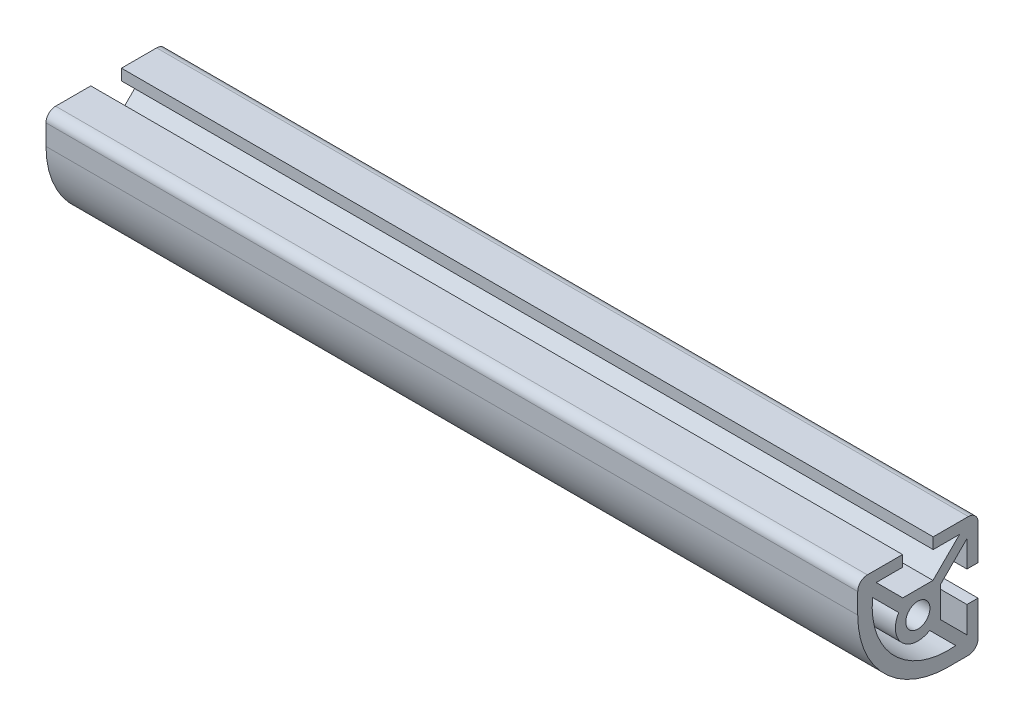
ISO-10303-21;
HEADER;
FILE_DESCRIPTION(('STEP AP214'),'2;1');
FILE_NAME('part.step','',(''),(''),'','','');
FILE_SCHEMA(('AUTOMOTIVE_DESIGN { 1 0 10303 214 1 1 1 1 }'));
ENDSEC;
DATA;
#1=APPLICATION_CONTEXT('core data for automotive mechanical design processes');
#2=APPLICATION_PROTOCOL_DEFINITION('international standard','automotive_design',2000,#1);
#3=PRODUCT_CONTEXT('',#1,'mechanical');
#4=PRODUCT('Part','Part','',(#3));
#5=PRODUCT_RELATED_PRODUCT_CATEGORY('part','',(#4));
#6=PRODUCT_DEFINITION_FORMATION('','',#4);
#7=PRODUCT_DEFINITION_CONTEXT('part definition',#1,'design');
#8=PRODUCT_DEFINITION('design','',#6,#7);
#9=PRODUCT_DEFINITION_SHAPE('','',#8);
#10=(LENGTH_UNIT() NAMED_UNIT(*) SI_UNIT(.MILLI.,.METRE.));
#11=(NAMED_UNIT(*) PLANE_ANGLE_UNIT() SI_UNIT($,.RADIAN.));
#12=(NAMED_UNIT(*) SI_UNIT($,.STERADIAN.) SOLID_ANGLE_UNIT());
#13=UNCERTAINTY_MEASURE_WITH_UNIT(LENGTH_MEASURE(1.E-05),#10,'distance_accuracy_value','');
#14=(GEOMETRIC_REPRESENTATION_CONTEXT(3) GLOBAL_UNCERTAINTY_ASSIGNED_CONTEXT((#13)) GLOBAL_UNIT_ASSIGNED_CONTEXT((#10,
#11,#12)) REPRESENTATION_CONTEXT('',''));
#15=CARTESIAN_POINT('',(0.,0.,0.));
#16=DIRECTION('',(0.,0.,1.));
#17=DIRECTION('',(1.,0.,0.));
#18=AXIS2_PLACEMENT_3D('',#15,#16,#17);
#19=CARTESIAN_POINT('',(85.7250000000001,10.668,10.6679999999999));
#20=DIRECTION('',(-1.,0.,0.));
#21=DIRECTION('',(0.,0.,1.));
#22=AXIS2_PLACEMENT_3D('',#19,#20,#21);
#23=PLANE('',#22);
#24=CARTESIAN_POINT('',(85.7250000000001,10.668,10.6679999999999));
#25=DIRECTION('',(1.,0.,0.));
#26=DIRECTION('',(0.,0.,1.));
#27=AXIS2_PLACEMENT_3D('',#24,#25,#26);
#28=CIRCLE('',#27,2.03200000000002);
#29=CARTESIAN_POINT('',(85.7250000000001,12.7,10.6679999999999));
#30=VERTEX_POINT('',#29);
#31=CARTESIAN_POINT('',(85.7250000000001,10.668,12.6999999999999));
#32=VERTEX_POINT('',#31);
#33=EDGE_CURVE('E229',#30,#32,#28,.T.);
#34=ORIENTED_EDGE('',*,*,#33,.T.);
#35=DIRECTION('',(0.,-1.,0.));
#36=VECTOR('',#35,1.);
#37=CARTESIAN_POINT('',(85.7250000000001,10.668,12.6999999999999));
#38=LINE('',#37,#36);
#39=CARTESIAN_POINT('',(85.7250000000001,6.35000000000034,12.6999999999999));
#40=VERTEX_POINT('',#39);
#41=EDGE_CURVE('E338',#32,#40,#38,.T.);
#42=ORIENTED_EDGE('',*,*,#41,.T.);
#43=CARTESIAN_POINT('',(85.7250000000001,6.35,-6.35000000000011));
#44=DIRECTION('',(1.,0.,0.));
#45=DIRECTION('',(0.,0.,-1.));
#46=AXIS2_PLACEMENT_3D('',#43,#44,#45);
#47=CIRCLE('',#46,19.05);
#48=CARTESIAN_POINT('',(85.7250000000001,-12.7,-6.35000000000012));
#49=VERTEX_POINT('',#48);
#50=EDGE_CURVE('E340',#40,#49,#47,.T.);
#51=ORIENTED_EDGE('',*,*,#50,.T.);
#52=DIRECTION('',(0.,0.,-1.));
#53=VECTOR('',#52,1.);
#54=CARTESIAN_POINT('',(85.7250000000001,-12.7,-10.6679999999999));
#55=LINE('',#54,#53);
#56=CARTESIAN_POINT('',(85.7250000000001,-12.7,-10.6679999999999));
#57=VERTEX_POINT('',#56);
#58=EDGE_CURVE('E342',#49,#57,#55,.T.);
#59=ORIENTED_EDGE('',*,*,#58,.T.);
#60=CARTESIAN_POINT('',(85.7250000000001,-10.668,-10.6679999999999));
#61=DIRECTION('',(1.,0.,0.));
#62=DIRECTION('',(0.,0.,1.));
#63=AXIS2_PLACEMENT_3D('',#60,#61,#62);
#64=CIRCLE('',#63,2.03200000000001);
#65=CARTESIAN_POINT('',(85.7250000000001,-10.668,-12.6999999999999));
#66=VERTEX_POINT('',#65);
#67=EDGE_CURVE('E344',#57,#66,#64,.T.);
#68=ORIENTED_EDGE('',*,*,#67,.T.);
#69=DIRECTION('',(0.,1.,0.));
#70=VECTOR('',#69,1.);
#71=CARTESIAN_POINT('',(85.7250000000001,-3.23850000000069,-12.6999999999999));
#72=LINE('',#71,#70);
#73=CARTESIAN_POINT('',(85.7250000000001,-3.23850000000069,-12.6999999999999));
#74=VERTEX_POINT('',#73);
#75=EDGE_CURVE('E346',#66,#74,#72,.T.);
#76=ORIENTED_EDGE('',*,*,#75,.T.);
#77=DIRECTION('',(0.,0.,1.));
#78=VECTOR('',#77,1.);
#79=CARTESIAN_POINT('',(85.7250000000001,-3.23850000000054,-10.3632000000016));
#80=LINE('',#79,#78);
#81=CARTESIAN_POINT('',(85.7250000000001,-3.23850000000054,-10.3632000000016));
#82=VERTEX_POINT('',#81);
#83=EDGE_CURVE('E348',#74,#82,#80,.T.);
#84=ORIENTED_EDGE('',*,*,#83,.T.);
#85=DIRECTION('',(0.,-1.,0.));
#86=VECTOR('',#85,1.);
#87=CARTESIAN_POINT('',(85.7250000000001,-8.80063543493584,-10.3632000000016));
#88=LINE('',#87,#86);
#89=CARTESIAN_POINT('',(85.7250000000001,-8.80063543493584,-10.3632000000016));
#90=VERTEX_POINT('',#89);
#91=EDGE_CURVE('E350',#82,#90,#88,.T.);
#92=ORIENTED_EDGE('',*,*,#91,.T.);
#93=DIRECTION('',(0.,0.707106781186543,0.707106781186552));
#94=VECTOR('',#93,1.);
#95=CARTESIAN_POINT('',(85.7250000000001,-3.18723566949115,-4.74980023455686));
#96=LINE('',#95,#94);
#97=CARTESIAN_POINT('',(85.7250000000001,-3.18723566949115,-4.74980023455686));
#98=VERTEX_POINT('',#97);
#99=EDGE_CURVE('E352',#90,#98,#96,.T.);
#100=ORIENTED_EDGE('',*,*,#99,.T.);
#101=DIRECTION('',(0.,1.,0.));
#102=VECTOR('',#101,1.);
#103=CARTESIAN_POINT('',(85.7250000000001,3.18723566949115,-4.74980023455665));
#104=LINE('',#103,#102);
#105=CARTESIAN_POINT('',(85.7250000000001,3.18723566949115,-4.74980023455665));
#106=VERTEX_POINT('',#105);
#107=EDGE_CURVE('E354',#98,#106,#104,.T.);
#108=ORIENTED_EDGE('',*,*,#107,.T.);
#109=DIRECTION('',(0.,0.707106781186543,-0.707106781186552));
#110=VECTOR('',#109,1.);
#111=CARTESIAN_POINT('',(85.7250000000001,8.80063543493585,-10.3632000000014));
#112=LINE('',#111,#110);
#113=CARTESIAN_POINT('',(85.7250000000001,8.80063543493585,-10.3632000000014));
#114=VERTEX_POINT('',#113);
#115=EDGE_CURVE('E356',#106,#114,#112,.T.);
#116=ORIENTED_EDGE('',*,*,#115,.T.);
#117=DIRECTION('',(0.,-1.,0.));
#118=VECTOR('',#117,1.);
#119=CARTESIAN_POINT('',(85.7250000000001,3.23850000000055,-10.3632000000014));
#120=LINE('',#119,#118);
#121=CARTESIAN_POINT('',(85.7250000000001,3.23850000000055,-10.3632000000014));
#122=VERTEX_POINT('',#121);
#123=EDGE_CURVE('E358',#114,#122,#120,.T.);
#124=ORIENTED_EDGE('',*,*,#123,.T.);
#125=DIRECTION('',(0.,0.,-1.));
#126=VECTOR('',#125,1.);
#127=CARTESIAN_POINT('',(85.7250000000001,3.23850000000069,-12.7));
#128=LINE('',#127,#126);
#129=CARTESIAN_POINT('',(85.7250000000001,3.23850000000069,-12.7));
#130=VERTEX_POINT('',#129);
#131=EDGE_CURVE('E360',#122,#130,#128,.T.);
#132=ORIENTED_EDGE('',*,*,#131,.T.);
#133=DIRECTION('',(0.,1.,0.));
#134=VECTOR('',#133,1.);
#135=CARTESIAN_POINT('',(85.7250000000001,10.668,-12.7));
#136=LINE('',#135,#134);
#137=CARTESIAN_POINT('',(85.7250000000001,10.668,-12.7));
#138=VERTEX_POINT('',#137);
#139=EDGE_CURVE('E362',#130,#138,#136,.T.);
#140=ORIENTED_EDGE('',*,*,#139,.T.);
#141=CARTESIAN_POINT('',(85.7250000000001,10.668,-10.668));
#142=DIRECTION('',(1.,0.,0.));
#143=DIRECTION('',(0.,0.,1.));
#144=AXIS2_PLACEMENT_3D('',#141,#142,#143);
#145=CIRCLE('',#144,2.03200000000001);
#146=CARTESIAN_POINT('',(85.7250000000001,12.7,-10.668));
#147=VERTEX_POINT('',#146);
#148=EDGE_CURVE('E364',#138,#147,#145,.T.);
#149=ORIENTED_EDGE('',*,*,#148,.T.);
#150=DIRECTION('',(0.,0.,1.));
#151=VECTOR('',#150,1.);
#152=CARTESIAN_POINT('',(85.7250000000001,12.7,-3.23850000000062));
#153=LINE('',#152,#151);
#154=CARTESIAN_POINT('',(85.7250000000001,12.7,-3.23850000000062));
#155=VERTEX_POINT('',#154);
#156=EDGE_CURVE('E366',#147,#155,#153,.T.);
#157=ORIENTED_EDGE('',*,*,#156,.T.);
#158=DIRECTION('',(0.,-1.,0.));
#159=VECTOR('',#158,1.);
#160=CARTESIAN_POINT('',(85.7250000000001,10.3632000000014,-3.23850000000062));
#161=LINE('',#160,#159);
#162=CARTESIAN_POINT('',(85.7250000000001,10.3632000000014,-3.23850000000062));
#163=VERTEX_POINT('',#162);
#164=EDGE_CURVE('E368',#155,#163,#161,.T.);
#165=ORIENTED_EDGE('',*,*,#164,.T.);
#166=DIRECTION('',(0.,0.,-1.));
#167=VECTOR('',#166,1.);
#168=CARTESIAN_POINT('',(85.7250000000001,10.3632000000014,-8.80063543493592));
#169=LINE('',#168,#167);
#170=CARTESIAN_POINT('',(85.7250000000001,10.3632000000014,-8.80063543493592));
#171=VERTEX_POINT('',#170);
#172=EDGE_CURVE('E370',#163,#171,#169,.T.);
#173=ORIENTED_EDGE('',*,*,#172,.T.);
#174=DIRECTION('',(0.,-0.707106781186537,0.707106781186558));
#175=VECTOR('',#174,1.);
#176=CARTESIAN_POINT('',(85.7250000000001,4.74980023455676,-3.18723566949106));
#177=LINE('',#176,#175);
#178=CARTESIAN_POINT('',(85.7250000000001,4.74980023455676,-3.18723566949106));
#179=VERTEX_POINT('',#178);
#180=EDGE_CURVE('E372',#171,#179,#177,.T.);
#181=ORIENTED_EDGE('',*,*,#180,.T.);
#182=DIRECTION('',(0.,0.,1.));
#183=VECTOR('',#182,1.);
#184=CARTESIAN_POINT('',(85.7250000000001,4.74980023455676,3.18723566949115));
#185=LINE('',#184,#183);
#186=CARTESIAN_POINT('',(85.7250000000001,4.74980023455676,3.18723566949115));
#187=VERTEX_POINT('',#186);
#188=EDGE_CURVE('E374',#179,#187,#185,.T.);
#189=ORIENTED_EDGE('',*,*,#188,.T.);
#190=DIRECTION('',(0.,0.707106781186543,0.707106781186552));
#191=VECTOR('',#190,1.);
#192=CARTESIAN_POINT('',(85.7250000000001,10.3632000000014,8.80063543493592));
#193=LINE('',#192,#191);
#194=CARTESIAN_POINT('',(85.7250000000001,10.3632000000014,8.80063543493592));
#195=VERTEX_POINT('',#194);
#196=EDGE_CURVE('E376',#187,#195,#193,.T.);
#197=ORIENTED_EDGE('',*,*,#196,.T.);
#198=DIRECTION('',(0.,0.,-1.));
#199=VECTOR('',#198,1.);
#200=CARTESIAN_POINT('',(85.7250000000001,10.3632000000014,3.23850000000062));
#201=LINE('',#200,#199);
#202=CARTESIAN_POINT('',(85.7250000000001,10.3632000000014,3.23850000000062));
#203=VERTEX_POINT('',#202);
#204=EDGE_CURVE('E378',#195,#203,#201,.T.);
#205=ORIENTED_EDGE('',*,*,#204,.T.);
#206=DIRECTION('',(0.,1.,0.));
#207=VECTOR('',#206,1.);
#208=CARTESIAN_POINT('',(85.7250000000001,12.7,3.23850000000062));
#209=LINE('',#208,#207);
#210=CARTESIAN_POINT('',(85.7250000000001,12.7,3.23850000000062));
#211=VERTEX_POINT('',#210);
#212=EDGE_CURVE('E380',#203,#211,#209,.T.);
#213=ORIENTED_EDGE('',*,*,#212,.T.);
#214=DIRECTION('',(0.,0.,1.));
#215=VECTOR('',#214,1.);
#216=CARTESIAN_POINT('',(85.7250000000001,12.7,10.6679999999999));
#217=LINE('',#216,#215);
#218=EDGE_CURVE('E56',#211,#30,#217,.T.);
#219=ORIENTED_EDGE('',*,*,#218,.T.);
#220=EDGE_LOOP('',(#34,#42,#51,#59,#68,#76,#84,#92,#100,#108,#116,#124,#132,#140,#149,#157,#165,
#173,#181,#189,#197,#205,#213,#219));
#221=FACE_BOUND('',#220,.T.);
#222=CARTESIAN_POINT('',(85.7250000000001,0.,0.));
#223=DIRECTION('',(-1.,0.,0.));
#224=DIRECTION('',(0.,0.,-1.));
#225=AXIS2_PLACEMENT_3D('',#222,#223,#224);
#226=CIRCLE('',#225,4.74980023455676);
#227=CARTESIAN_POINT('',(85.7250000000001,-4.04776343648096,-2.48519887141517));
#228=VERTEX_POINT('',#227);
#229=CARTESIAN_POINT('',(85.7250000000001,2.48519887141525,4.04776343648091));
#230=VERTEX_POINT('',#229);
#231=EDGE_CURVE('E226',#228,#230,#226,.T.);
#232=ORIENTED_EDGE('',*,*,#231,.F.);
#233=DIRECTION('',(0.,0.707106781186554,0.707106781186541));
#234=VECTOR('',#233,1.);
#235=CARTESIAN_POINT('',(85.7250000000001,-4.04776343648096,-2.48519887141517));
#236=LINE('',#235,#234);
#237=CARTESIAN_POINT('',(85.7250000000001,-9.56631586282329,-8.00375129775741));
#238=VERTEX_POINT('',#237);
#239=EDGE_CURVE('E331',#238,#228,#236,.T.);
#240=ORIENTED_EDGE('',*,*,#239,.F.);
#241=CARTESIAN_POINT('',(85.7250000000001,6.34999999999999,-6.35000000000011));
#242=DIRECTION('',(1.,0.,0.));
#243=DIRECTION('',(0.,0.,-1.));
#244=AXIS2_PLACEMENT_3D('',#241,#242,#243);
#245=CIRCLE('',#244,16.0019999999998);
#246=CARTESIAN_POINT('',(85.7250000000001,8.00375129775759,9.56631586282315));
#247=VERTEX_POINT('',#246);
#248=EDGE_CURVE('E329',#247,#238,#245,.T.);
#249=ORIENTED_EDGE('',*,*,#248,.F.);
#250=DIRECTION('',(0.,0.707106781186554,0.707106781186541));
#251=VECTOR('',#250,1.);
#252=CARTESIAN_POINT('',(85.7250000000001,8.00375129775759,9.56631586282315));
#253=LINE('',#252,#251);
#254=EDGE_CURVE('E327',#230,#247,#253,.T.);
#255=ORIENTED_EDGE('',*,*,#254,.F.);
#256=EDGE_LOOP('',(#232,#240,#249,#255));
#257=FACE_BOUND('',#256,.T.);
#258=CARTESIAN_POINT('',(85.7250000000001,0.,0.));
#259=DIRECTION('',(1.,0.,0.));
#260=DIRECTION('',(0.,0.,-1.));
#261=AXIS2_PLACEMENT_3D('',#258,#259,#260);
#262=CIRCLE('',#261,2.55269999999991);
#263=CARTESIAN_POINT('',(85.7250000000001,0.,-2.55269999999991));
#264=VERTEX_POINT('',#263);
#265=EDGE_CURVE('E323',#264,#264,#262,.T.);
#266=ORIENTED_EDGE('',*,*,#265,.F.);
#267=EDGE_LOOP('',(#266));
#268=FACE_BOUND('',#267,.T.);
#269=ADVANCED_FACE('F33',(#221,#257,#268),#23,.F.);
#270=CARTESIAN_POINT('',(85.7250000000001,10.668,10.6679999999999));
#271=DIRECTION('',(-1.,0.,0.));
#272=DIRECTION('',(0.,0.,1.));
#273=AXIS2_PLACEMENT_3D('',#270,#271,#272);
#274=CYLINDRICAL_SURFACE('',#273,2.03200000000002);
#275=DIRECTION('',(-1.,0.,0.));
#276=VECTOR('',#275,1.);
#277=CARTESIAN_POINT('',(85.7250000000001,12.7,10.6679999999999));
#278=LINE('',#277,#276);
#279=CARTESIAN_POINT('',(-85.7250000000001,12.7,10.6679999999999));
#280=VERTEX_POINT('',#279);
#281=EDGE_CURVE('E383',#30,#280,#278,.T.);
#282=ORIENTED_EDGE('',*,*,#281,.T.);
#283=CARTESIAN_POINT('',(-85.7250000000001,10.668,10.6679999999999));
#284=DIRECTION('',(1.,0.,0.));
#285=DIRECTION('',(0.,0.,1.));
#286=AXIS2_PLACEMENT_3D('',#283,#284,#285);
#287=CIRCLE('',#286,2.03200000000002);
#288=CARTESIAN_POINT('',(-85.7250000000001,10.668,12.6999999999999));
#289=VERTEX_POINT('',#288);
#290=EDGE_CURVE('E251',#280,#289,#287,.T.);
#291=ORIENTED_EDGE('',*,*,#290,.T.);
#292=DIRECTION('',(-1.,0.,0.));
#293=VECTOR('',#292,1.);
#294=CARTESIAN_POINT('',(85.7250000000001,10.668,12.6999999999999));
#295=LINE('',#294,#293);
#296=EDGE_CURVE('E11',#32,#289,#295,.T.);
#297=ORIENTED_EDGE('',*,*,#296,.F.);
#298=ORIENTED_EDGE('',*,*,#33,.F.);
#299=EDGE_LOOP('',(#282,#291,#297,#298));
#300=FACE_BOUND('',#299,.T.);
#301=ADVANCED_FACE('F35',(#300),#274,.T.);
#302=CARTESIAN_POINT('',(85.7250000000001,10.668,12.6999999999999));
#303=DIRECTION('',(0.,0.,-1.));
#304=DIRECTION('',(-1.,0.,0.));
#305=AXIS2_PLACEMENT_3D('',#302,#303,#304);
#306=PLANE('',#305);
#307=ORIENTED_EDGE('',*,*,#296,.T.);
#308=DIRECTION('',(0.,-1.,0.));
#309=VECTOR('',#308,1.);
#310=CARTESIAN_POINT('',(-85.7250000000001,10.668,12.6999999999999));
#311=LINE('',#310,#309);
#312=CARTESIAN_POINT('',(-85.7250000000001,6.35000000000034,12.6999999999999));
#313=VERTEX_POINT('',#312);
#314=EDGE_CURVE('E254',#289,#313,#311,.T.);
#315=ORIENTED_EDGE('',*,*,#314,.T.);
#316=DIRECTION('',(-1.,0.,0.));
#317=VECTOR('',#316,1.);
#318=CARTESIAN_POINT('',(85.7250000000001,6.35000000000034,12.6999999999999));
#319=LINE('',#318,#317);
#320=EDGE_CURVE('E41',#40,#313,#319,.T.);
#321=ORIENTED_EDGE('',*,*,#320,.F.);
#322=ORIENTED_EDGE('',*,*,#41,.F.);
#323=EDGE_LOOP('',(#307,#315,#321,#322));
#324=FACE_BOUND('',#323,.T.);
#325=ADVANCED_FACE('F437',(#324),#306,.F.);
#326=CARTESIAN_POINT('',(85.7250000000001,6.35,-6.35000000000011));
#327=DIRECTION('',(-1.,0.,0.));
#328=DIRECTION('',(0.,0.,1.));
#329=AXIS2_PLACEMENT_3D('',#326,#327,#328);
#330=CYLINDRICAL_SURFACE('',#329,19.05);
#331=ORIENTED_EDGE('',*,*,#320,.T.);
#332=CARTESIAN_POINT('',(-85.7250000000001,6.35,-6.35000000000011));
#333=DIRECTION('',(1.,0.,0.));
#334=DIRECTION('',(0.,0.,-1.));
#335=AXIS2_PLACEMENT_3D('',#332,#333,#334);
#336=CIRCLE('',#335,19.05);
#337=CARTESIAN_POINT('',(-85.7250000000001,-12.7,-6.35000000000012));
#338=VERTEX_POINT('',#337);
#339=EDGE_CURVE('E257',#313,#338,#336,.T.);
#340=ORIENTED_EDGE('',*,*,#339,.T.);
#341=DIRECTION('',(-1.,0.,0.));
#342=VECTOR('',#341,1.);
#343=CARTESIAN_POINT('',(85.7250000000001,-12.7,-6.35000000000012));
#344=LINE('',#343,#342);
#345=EDGE_CURVE('E425',#49,#338,#344,.T.);
#346=ORIENTED_EDGE('',*,*,#345,.F.);
#347=ORIENTED_EDGE('',*,*,#50,.F.);
#348=EDGE_LOOP('',(#331,#340,#346,#347));
#349=FACE_BOUND('',#348,.T.);
#350=ADVANCED_FACE('F430',(#349),#330,.T.);
#351=CARTESIAN_POINT('',(85.7250000000001,-12.7,-10.6679999999999));
#352=DIRECTION('',(0.,1.,0.));
#353=DIRECTION('',(0.,0.,1.));
#354=AXIS2_PLACEMENT_3D('',#351,#352,#353);
#355=PLANE('',#354);
#356=ORIENTED_EDGE('',*,*,#345,.T.);
#357=DIRECTION('',(0.,0.,-1.));
#358=VECTOR('',#357,1.);
#359=CARTESIAN_POINT('',(-85.7250000000001,-12.7,-10.6679999999999));
#360=LINE('',#359,#358);
#361=CARTESIAN_POINT('',(-85.7250000000001,-12.7,-10.6679999999999));
#362=VERTEX_POINT('',#361);
#363=EDGE_CURVE('E260',#338,#362,#360,.T.);
#364=ORIENTED_EDGE('',*,*,#363,.T.);
#365=DIRECTION('',(-1.,0.,0.));
#366=VECTOR('',#365,1.);
#367=CARTESIAN_POINT('',(85.7250000000001,-12.7,-10.6679999999999));
#368=LINE('',#367,#366);
#369=EDGE_CURVE('E423',#57,#362,#368,.T.);
#370=ORIENTED_EDGE('',*,*,#369,.F.);
#371=ORIENTED_EDGE('',*,*,#58,.F.);
#372=EDGE_LOOP('',(#356,#364,#370,#371));
#373=FACE_BOUND('',#372,.T.);
#374=ADVANCED_FACE('F540',(#373),#355,.F.);
#375=CARTESIAN_POINT('',(85.7250000000001,-10.668,-10.6679999999999));
#376=DIRECTION('',(-1.,0.,0.));
#377=DIRECTION('',(0.,0.,1.));
#378=AXIS2_PLACEMENT_3D('',#375,#376,#377);
#379=CYLINDRICAL_SURFACE('',#378,2.03200000000001);
#380=ORIENTED_EDGE('',*,*,#369,.T.);
#381=CARTESIAN_POINT('',(-85.7250000000001,-10.668,-10.6679999999999));
#382=DIRECTION('',(1.,0.,0.));
#383=DIRECTION('',(0.,0.,1.));
#384=AXIS2_PLACEMENT_3D('',#381,#382,#383);
#385=CIRCLE('',#384,2.03200000000001);
#386=CARTESIAN_POINT('',(-85.7250000000001,-10.668,-12.6999999999999));
#387=VERTEX_POINT('',#386);
#388=EDGE_CURVE('E263',#362,#387,#385,.T.);
#389=ORIENTED_EDGE('',*,*,#388,.T.);
#390=DIRECTION('',(-1.,0.,0.));
#391=VECTOR('',#390,1.);
#392=CARTESIAN_POINT('',(85.7250000000001,-10.668,-12.6999999999999));
#393=LINE('',#392,#391);
#394=EDGE_CURVE('E421',#66,#387,#393,.T.);
#395=ORIENTED_EDGE('',*,*,#394,.F.);
#396=ORIENTED_EDGE('',*,*,#67,.F.);
#397=EDGE_LOOP('',(#380,#389,#395,#396));
#398=FACE_BOUND('',#397,.T.);
#399=ADVANCED_FACE('F537',(#398),#379,.T.);
#400=CARTESIAN_POINT('',(85.7250000000001,-3.23850000000069,-12.6999999999999));
#401=DIRECTION('',(0.,0.,1.));
#402=DIRECTION('',(1.,0.,0.));
#403=AXIS2_PLACEMENT_3D('',#400,#401,#402);
#404=PLANE('',#403);
#405=ORIENTED_EDGE('',*,*,#394,.T.);
#406=DIRECTION('',(0.,1.,0.));
#407=VECTOR('',#406,1.);
#408=CARTESIAN_POINT('',(-85.7250000000001,-3.23850000000069,-12.6999999999999));
#409=LINE('',#408,#407);
#410=CARTESIAN_POINT('',(-85.7250000000001,-3.23850000000069,-12.6999999999999));
#411=VERTEX_POINT('',#410);
#412=EDGE_CURVE('E266',#387,#411,#409,.T.);
#413=ORIENTED_EDGE('',*,*,#412,.T.);
#414=DIRECTION('',(-1.,0.,0.));
#415=VECTOR('',#414,1.);
#416=CARTESIAN_POINT('',(85.7250000000001,-3.23850000000069,-12.6999999999999));
#417=LINE('',#416,#415);
#418=EDGE_CURVE('E419',#74,#411,#417,.T.);
#419=ORIENTED_EDGE('',*,*,#418,.F.);
#420=ORIENTED_EDGE('',*,*,#75,.F.);
#421=EDGE_LOOP('',(#405,#413,#419,#420));
#422=FACE_BOUND('',#421,.T.);
#423=ADVANCED_FACE('F532',(#422),#404,.F.);
#424=CARTESIAN_POINT('',(85.7250000000001,-3.23850000000054,-10.3632000000016));
#425=DIRECTION('',(0.,-1.,0.));
#426=DIRECTION('',(0.,0.,-1.));
#427=AXIS2_PLACEMENT_3D('',#424,#425,#426);
#428=PLANE('',#427);
#429=ORIENTED_EDGE('',*,*,#418,.T.);
#430=DIRECTION('',(0.,0.,1.));
#431=VECTOR('',#430,1.);
#432=CARTESIAN_POINT('',(-85.7250000000001,-3.23850000000054,-10.3632000000016));
#433=LINE('',#432,#431);
#434=CARTESIAN_POINT('',(-85.7250000000001,-3.23850000000054,-10.3632000000016));
#435=VERTEX_POINT('',#434);
#436=EDGE_CURVE('E269',#411,#435,#433,.T.);
#437=ORIENTED_EDGE('',*,*,#436,.T.);
#438=DIRECTION('',(-1.,0.,0.));
#439=VECTOR('',#438,1.);
#440=CARTESIAN_POINT('',(85.7250000000001,-3.23850000000054,-10.3632000000016));
#441=LINE('',#440,#439);
#442=EDGE_CURVE('E417',#82,#435,#441,.T.);
#443=ORIENTED_EDGE('',*,*,#442,.F.);
#444=ORIENTED_EDGE('',*,*,#83,.F.);
#445=EDGE_LOOP('',(#429,#437,#443,#444));
#446=FACE_BOUND('',#445,.T.);
#447=ADVANCED_FACE('F528',(#446),#428,.F.);
#448=CARTESIAN_POINT('',(85.7250000000001,-8.80063543493584,-10.3632000000016));
#449=DIRECTION('',(0.,0.,-1.));
#450=DIRECTION('',(-1.,0.,0.));
#451=AXIS2_PLACEMENT_3D('',#448,#449,#450);
#452=PLANE('',#451);
#453=ORIENTED_EDGE('',*,*,#442,.T.);
#454=DIRECTION('',(0.,-1.,0.));
#455=VECTOR('',#454,1.);
#456=CARTESIAN_POINT('',(-85.7250000000001,-8.80063543493584,-10.3632000000016));
#457=LINE('',#456,#455);
#458=CARTESIAN_POINT('',(-85.7250000000001,-8.80063543493584,-10.3632000000016));
#459=VERTEX_POINT('',#458);
#460=EDGE_CURVE('E272',#435,#459,#457,.T.);
#461=ORIENTED_EDGE('',*,*,#460,.T.);
#462=DIRECTION('',(-1.,0.,0.));
#463=VECTOR('',#462,1.);
#464=CARTESIAN_POINT('',(85.7250000000001,-8.80063543493584,-10.3632000000016));
#465=LINE('',#464,#463);
#466=EDGE_CURVE('E415',#90,#459,#465,.T.);
#467=ORIENTED_EDGE('',*,*,#466,.F.);
#468=ORIENTED_EDGE('',*,*,#91,.F.);
#469=EDGE_LOOP('',(#453,#461,#467,#468));
#470=FACE_BOUND('',#469,.T.);
#471=ADVANCED_FACE('F523',(#470),#452,.F.);
#472=CARTESIAN_POINT('',(85.7250000000001,-3.18723566949115,-4.74980023455686));
#473=DIRECTION('',(0.,-0.707106781186552,0.707106781186543));
#474=DIRECTION('',(0.,-0.707106781186543,-0.707106781186552));
#475=AXIS2_PLACEMENT_3D('',#472,#473,#474);
#476=PLANE('',#475);
#477=ORIENTED_EDGE('',*,*,#466,.T.);
#478=DIRECTION('',(0.,0.707106781186543,0.707106781186552));
#479=VECTOR('',#478,1.);
#480=CARTESIAN_POINT('',(-85.7250000000001,-3.18723566949115,-4.74980023455686));
#481=LINE('',#480,#479);
#482=CARTESIAN_POINT('',(-85.7250000000001,-3.18723566949115,-4.74980023455686));
#483=VERTEX_POINT('',#482);
#484=EDGE_CURVE('E275',#459,#483,#481,.T.);
#485=ORIENTED_EDGE('',*,*,#484,.T.);
#486=DIRECTION('',(-1.,0.,0.));
#487=VECTOR('',#486,1.);
#488=CARTESIAN_POINT('',(85.7250000000001,-3.18723566949115,-4.74980023455686));
#489=LINE('',#488,#487);
#490=EDGE_CURVE('E413',#98,#483,#489,.T.);
#491=ORIENTED_EDGE('',*,*,#490,.F.);
#492=ORIENTED_EDGE('',*,*,#99,.F.);
#493=EDGE_LOOP('',(#477,#485,#491,#492));
#494=FACE_BOUND('',#493,.T.);
#495=ADVANCED_FACE('F518',(#494),#476,.F.);
#496=CARTESIAN_POINT('',(85.7250000000001,3.18723566949115,-4.74980023455665));
#497=DIRECTION('',(0.,0.,1.));
#498=DIRECTION('',(0.,-1.,0.));
#499=AXIS2_PLACEMENT_3D('',#496,#497,#498);
#500=PLANE('',#499);
#501=ORIENTED_EDGE('',*,*,#490,.T.);
#502=DIRECTION('',(0.,1.,0.));
#503=VECTOR('',#502,1.);
#504=CARTESIAN_POINT('',(-85.7250000000001,3.18723566949115,-4.74980023455665));
#505=LINE('',#504,#503);
#506=CARTESIAN_POINT('',(-85.7250000000001,3.18723566949115,-4.74980023455665));
#507=VERTEX_POINT('',#506);
#508=EDGE_CURVE('E278',#483,#507,#505,.T.);
#509=ORIENTED_EDGE('',*,*,#508,.T.);
#510=DIRECTION('',(-1.,0.,0.));
#511=VECTOR('',#510,1.);
#512=CARTESIAN_POINT('',(85.7250000000001,3.18723566949115,-4.74980023455665));
#513=LINE('',#512,#511);
#514=EDGE_CURVE('E411',#106,#507,#513,.T.);
#515=ORIENTED_EDGE('',*,*,#514,.F.);
#516=ORIENTED_EDGE('',*,*,#107,.F.);
#517=EDGE_LOOP('',(#501,#509,#515,#516));
#518=FACE_BOUND('',#517,.T.);
#519=ADVANCED_FACE('F513',(#518),#500,.F.);
#520=CARTESIAN_POINT('',(85.7250000000001,8.80063543493585,-10.3632000000014));
#521=DIRECTION('',(0.,0.707106781186552,0.707106781186543));
#522=DIRECTION('',(0.,-0.707106781186543,0.707106781186552));
#523=AXIS2_PLACEMENT_3D('',#520,#521,#522);
#524=PLANE('',#523);
#525=ORIENTED_EDGE('',*,*,#514,.T.);
#526=DIRECTION('',(0.,0.707106781186543,-0.707106781186552));
#527=VECTOR('',#526,1.);
#528=CARTESIAN_POINT('',(-85.7250000000001,8.80063543493585,-10.3632000000014));
#529=LINE('',#528,#527);
#530=CARTESIAN_POINT('',(-85.7250000000001,8.80063543493585,-10.3632000000014));
#531=VERTEX_POINT('',#530);
#532=EDGE_CURVE('E281',#507,#531,#529,.T.);
#533=ORIENTED_EDGE('',*,*,#532,.T.);
#534=DIRECTION('',(-1.,0.,0.));
#535=VECTOR('',#534,1.);
#536=CARTESIAN_POINT('',(85.7250000000001,8.80063543493585,-10.3632000000014));
#537=LINE('',#536,#535);
#538=EDGE_CURVE('E409',#114,#531,#537,.T.);
#539=ORIENTED_EDGE('',*,*,#538,.F.);
#540=ORIENTED_EDGE('',*,*,#115,.F.);
#541=EDGE_LOOP('',(#525,#533,#539,#540));
#542=FACE_BOUND('',#541,.T.);
#543=ADVANCED_FACE('F508',(#542),#524,.F.);
#544=CARTESIAN_POINT('',(85.7250000000001,3.23850000000055,-10.3632000000014));
#545=DIRECTION('',(0.,0.,-1.));
#546=DIRECTION('',(-1.,0.,0.));
#547=AXIS2_PLACEMENT_3D('',#544,#545,#546);
#548=PLANE('',#547);
#549=ORIENTED_EDGE('',*,*,#538,.T.);
#550=DIRECTION('',(0.,-1.,0.));
#551=VECTOR('',#550,1.);
#552=CARTESIAN_POINT('',(-85.7250000000001,3.23850000000055,-10.3632000000014));
#553=LINE('',#552,#551);
#554=CARTESIAN_POINT('',(-85.7250000000001,3.23850000000055,-10.3632000000014));
#555=VERTEX_POINT('',#554);
#556=EDGE_CURVE('E284',#531,#555,#553,.T.);
#557=ORIENTED_EDGE('',*,*,#556,.T.);
#558=DIRECTION('',(-1.,0.,0.));
#559=VECTOR('',#558,1.);
#560=CARTESIAN_POINT('',(85.7250000000001,3.23850000000055,-10.3632000000014));
#561=LINE('',#560,#559);
#562=EDGE_CURVE('E407',#122,#555,#561,.T.);
#563=ORIENTED_EDGE('',*,*,#562,.F.);
#564=ORIENTED_EDGE('',*,*,#123,.F.);
#565=EDGE_LOOP('',(#549,#557,#563,#564));
#566=FACE_BOUND('',#565,.T.);
#567=ADVANCED_FACE('F503',(#566),#548,.F.);
#568=CARTESIAN_POINT('',(85.7250000000001,3.23850000000069,-12.7));
#569=DIRECTION('',(0.,1.,0.));
#570=DIRECTION('',(0.,0.,1.));
#571=AXIS2_PLACEMENT_3D('',#568,#569,#570);
#572=PLANE('',#571);
#573=ORIENTED_EDGE('',*,*,#562,.T.);
#574=DIRECTION('',(0.,0.,-1.));
#575=VECTOR('',#574,1.);
#576=CARTESIAN_POINT('',(-85.7250000000001,3.23850000000069,-12.7));
#577=LINE('',#576,#575);
#578=CARTESIAN_POINT('',(-85.7250000000001,3.23850000000069,-12.7));
#579=VERTEX_POINT('',#578);
#580=EDGE_CURVE('E287',#555,#579,#577,.T.);
#581=ORIENTED_EDGE('',*,*,#580,.T.);
#582=DIRECTION('',(-1.,0.,0.));
#583=VECTOR('',#582,1.);
#584=CARTESIAN_POINT('',(85.7250000000001,3.23850000000069,-12.7));
#585=LINE('',#584,#583);
#586=EDGE_CURVE('E405',#130,#579,#585,.T.);
#587=ORIENTED_EDGE('',*,*,#586,.F.);
#588=ORIENTED_EDGE('',*,*,#131,.F.);
#589=EDGE_LOOP('',(#573,#581,#587,#588));
#590=FACE_BOUND('',#589,.T.);
#591=ADVANCED_FACE('F498',(#590),#572,.F.);
#592=CARTESIAN_POINT('',(85.7250000000001,10.668,-12.7));
#593=DIRECTION('',(0.,0.,1.));
#594=DIRECTION('',(1.,0.,0.));
#595=AXIS2_PLACEMENT_3D('',#592,#593,#594);
#596=PLANE('',#595);
#597=ORIENTED_EDGE('',*,*,#586,.T.);
#598=DIRECTION('',(0.,1.,0.));
#599=VECTOR('',#598,1.);
#600=CARTESIAN_POINT('',(-85.7250000000001,10.668,-12.7));
#601=LINE('',#600,#599);
#602=CARTESIAN_POINT('',(-85.7250000000001,10.668,-12.7));
#603=VERTEX_POINT('',#602);
#604=EDGE_CURVE('E290',#579,#603,#601,.T.);
#605=ORIENTED_EDGE('',*,*,#604,.T.);
#606=DIRECTION('',(-1.,0.,0.));
#607=VECTOR('',#606,1.);
#608=CARTESIAN_POINT('',(85.7250000000001,10.668,-12.7));
#609=LINE('',#608,#607);
#610=EDGE_CURVE('E403',#138,#603,#609,.T.);
#611=ORIENTED_EDGE('',*,*,#610,.F.);
#612=ORIENTED_EDGE('',*,*,#139,.F.);
#613=EDGE_LOOP('',(#597,#605,#611,#612));
#614=FACE_BOUND('',#613,.T.);
#615=ADVANCED_FACE('F493',(#614),#596,.F.);
#616=CARTESIAN_POINT('',(85.7250000000001,10.668,-10.668));
#617=DIRECTION('',(-1.,0.,0.));
#618=DIRECTION('',(0.,0.,1.));
#619=AXIS2_PLACEMENT_3D('',#616,#617,#618);
#620=CYLINDRICAL_SURFACE('',#619,2.03200000000001);
#621=ORIENTED_EDGE('',*,*,#610,.T.);
#622=CARTESIAN_POINT('',(-85.7250000000001,10.668,-10.668));
#623=DIRECTION('',(1.,0.,0.));
#624=DIRECTION('',(0.,0.,1.));
#625=AXIS2_PLACEMENT_3D('',#622,#623,#624);
#626=CIRCLE('',#625,2.03200000000001);
#627=CARTESIAN_POINT('',(-85.7250000000001,12.7,-10.668));
#628=VERTEX_POINT('',#627);
#629=EDGE_CURVE('E293',#603,#628,#626,.T.);
#630=ORIENTED_EDGE('',*,*,#629,.T.);
#631=DIRECTION('',(-1.,0.,0.));
#632=VECTOR('',#631,1.);
#633=CARTESIAN_POINT('',(85.7250000000001,12.7,-10.668));
#634=LINE('',#633,#632);
#635=EDGE_CURVE('E401',#147,#628,#634,.T.);
#636=ORIENTED_EDGE('',*,*,#635,.F.);
#637=ORIENTED_EDGE('',*,*,#148,.F.);
#638=EDGE_LOOP('',(#621,#630,#636,#637));
#639=FACE_BOUND('',#638,.T.);
#640=ADVANCED_FACE('F488',(#639),#620,.T.);
#641=CARTESIAN_POINT('',(85.7250000000001,12.7,-3.23850000000062));
#642=DIRECTION('',(0.,-1.,0.));
#643=DIRECTION('',(0.,0.,-1.));
#644=AXIS2_PLACEMENT_3D('',#641,#642,#643);
#645=PLANE('',#644);
#646=ORIENTED_EDGE('',*,*,#635,.T.);
#647=DIRECTION('',(0.,0.,1.));
#648=VECTOR('',#647,1.);
#649=CARTESIAN_POINT('',(-85.7250000000001,12.7,-3.23850000000062));
#650=LINE('',#649,#648);
#651=CARTESIAN_POINT('',(-85.7250000000001,12.7,-3.23850000000062));
#652=VERTEX_POINT('',#651);
#653=EDGE_CURVE('E296',#628,#652,#650,.T.);
#654=ORIENTED_EDGE('',*,*,#653,.T.);
#655=DIRECTION('',(-1.,0.,0.));
#656=VECTOR('',#655,1.);
#657=CARTESIAN_POINT('',(85.7250000000001,12.7,-3.23850000000062));
#658=LINE('',#657,#656);
#659=EDGE_CURVE('E399',#155,#652,#658,.T.);
#660=ORIENTED_EDGE('',*,*,#659,.F.);
#661=ORIENTED_EDGE('',*,*,#156,.F.);
#662=EDGE_LOOP('',(#646,#654,#660,#661));
#663=FACE_BOUND('',#662,.T.);
#664=ADVANCED_FACE('F483',(#663),#645,.F.);
#665=CARTESIAN_POINT('',(85.7250000000001,10.3632000000014,-3.23850000000062));
#666=DIRECTION('',(0.,0.,-1.));
#667=DIRECTION('',(-1.,0.,0.));
#668=AXIS2_PLACEMENT_3D('',#665,#666,#667);
#669=PLANE('',#668);
#670=ORIENTED_EDGE('',*,*,#659,.T.);
#671=DIRECTION('',(0.,-1.,0.));
#672=VECTOR('',#671,1.);
#673=CARTESIAN_POINT('',(-85.7250000000001,10.3632000000014,-3.23850000000062));
#674=LINE('',#673,#672);
#675=CARTESIAN_POINT('',(-85.7250000000001,10.3632000000014,-3.23850000000062));
#676=VERTEX_POINT('',#675);
#677=EDGE_CURVE('E299',#652,#676,#674,.T.);
#678=ORIENTED_EDGE('',*,*,#677,.T.);
#679=DIRECTION('',(-1.,0.,0.));
#680=VECTOR('',#679,1.);
#681=CARTESIAN_POINT('',(85.7250000000001,10.3632000000014,-3.23850000000062));
#682=LINE('',#681,#680);
#683=EDGE_CURVE('E397',#163,#676,#682,.T.);
#684=ORIENTED_EDGE('',*,*,#683,.F.);
#685=ORIENTED_EDGE('',*,*,#164,.F.);
#686=EDGE_LOOP('',(#670,#678,#684,#685));
#687=FACE_BOUND('',#686,.T.);
#688=ADVANCED_FACE('F478',(#687),#669,.F.);
#689=CARTESIAN_POINT('',(85.7250000000001,10.3632000000014,-8.80063543493592));
#690=DIRECTION('',(0.,1.,0.));
#691=DIRECTION('',(0.,0.,1.));
#692=AXIS2_PLACEMENT_3D('',#689,#690,#691);
#693=PLANE('',#692);
#694=ORIENTED_EDGE('',*,*,#683,.T.);
#695=DIRECTION('',(0.,0.,-1.));
#696=VECTOR('',#695,1.);
#697=CARTESIAN_POINT('',(-85.7250000000001,10.3632000000014,-8.80063543493592));
#698=LINE('',#697,#696);
#699=CARTESIAN_POINT('',(-85.7250000000001,10.3632000000014,-8.80063543493592));
#700=VERTEX_POINT('',#699);
#701=EDGE_CURVE('E302',#676,#700,#698,.T.);
#702=ORIENTED_EDGE('',*,*,#701,.T.);
#703=DIRECTION('',(-1.,0.,0.));
#704=VECTOR('',#703,1.);
#705=CARTESIAN_POINT('',(85.7250000000001,10.3632000000014,-8.80063543493592));
#706=LINE('',#705,#704);
#707=EDGE_CURVE('E395',#171,#700,#706,.T.);
#708=ORIENTED_EDGE('',*,*,#707,.F.);
#709=ORIENTED_EDGE('',*,*,#172,.F.);
#710=EDGE_LOOP('',(#694,#702,#708,#709));
#711=FACE_BOUND('',#710,.T.);
#712=ADVANCED_FACE('F473',(#711),#693,.F.);
#713=CARTESIAN_POINT('',(85.7250000000001,4.74980023455676,-3.18723566949106));
#714=DIRECTION('',(0.,-0.707106781186558,-0.707106781186537));
#715=DIRECTION('',(0.,0.707106781186537,-0.707106781186558));
#716=AXIS2_PLACEMENT_3D('',#713,#714,#715);
#717=PLANE('',#716);
#718=ORIENTED_EDGE('',*,*,#707,.T.);
#719=DIRECTION('',(0.,-0.707106781186537,0.707106781186558));
#720=VECTOR('',#719,1.);
#721=CARTESIAN_POINT('',(-85.7250000000001,4.74980023455676,-3.18723566949106));
#722=LINE('',#721,#720);
#723=CARTESIAN_POINT('',(-85.7250000000001,4.74980023455676,-3.18723566949106));
#724=VERTEX_POINT('',#723);
#725=EDGE_CURVE('E305',#700,#724,#722,.T.);
#726=ORIENTED_EDGE('',*,*,#725,.T.);
#727=DIRECTION('',(-1.,0.,0.));
#728=VECTOR('',#727,1.);
#729=CARTESIAN_POINT('',(85.7250000000001,4.74980023455676,-3.18723566949106));
#730=LINE('',#729,#728);
#731=EDGE_CURVE('E393',#179,#724,#730,.T.);
#732=ORIENTED_EDGE('',*,*,#731,.F.);
#733=ORIENTED_EDGE('',*,*,#180,.F.);
#734=EDGE_LOOP('',(#718,#726,#732,#733));
#735=FACE_BOUND('',#734,.T.);
#736=ADVANCED_FACE('F468',(#735),#717,.F.);
#737=CARTESIAN_POINT('',(85.7250000000001,4.74980023455676,3.18723566949115));
#738=DIRECTION('',(0.,-1.,0.));
#739=DIRECTION('',(0.,0.,-1.));
#740=AXIS2_PLACEMENT_3D('',#737,#738,#739);
#741=PLANE('',#740);
#742=ORIENTED_EDGE('',*,*,#731,.T.);
#743=DIRECTION('',(0.,0.,1.));
#744=VECTOR('',#743,1.);
#745=CARTESIAN_POINT('',(-85.7250000000001,4.74980023455676,3.18723566949115));
#746=LINE('',#745,#744);
#747=CARTESIAN_POINT('',(-85.7250000000001,4.74980023455676,3.18723566949115));
#748=VERTEX_POINT('',#747);
#749=EDGE_CURVE('E308',#724,#748,#746,.T.);
#750=ORIENTED_EDGE('',*,*,#749,.T.);
#751=DIRECTION('',(-1.,0.,0.));
#752=VECTOR('',#751,1.);
#753=CARTESIAN_POINT('',(85.7250000000001,4.74980023455676,3.18723566949115));
#754=LINE('',#753,#752);
#755=EDGE_CURVE('E391',#187,#748,#754,.T.);
#756=ORIENTED_EDGE('',*,*,#755,.F.);
#757=ORIENTED_EDGE('',*,*,#188,.F.);
#758=EDGE_LOOP('',(#742,#750,#756,#757));
#759=FACE_BOUND('',#758,.T.);
#760=ADVANCED_FACE('F463',(#759),#741,.F.);
#761=CARTESIAN_POINT('',(85.7250000000001,10.3632000000014,8.80063543493592));
#762=DIRECTION('',(0.,-0.707106781186552,0.707106781186543));
#763=DIRECTION('',(0.,-0.707106781186543,-0.707106781186552));
#764=AXIS2_PLACEMENT_3D('',#761,#762,#763);
#765=PLANE('',#764);
#766=ORIENTED_EDGE('',*,*,#755,.T.);
#767=DIRECTION('',(0.,0.707106781186543,0.707106781186552));
#768=VECTOR('',#767,1.);
#769=CARTESIAN_POINT('',(-85.7250000000001,10.3632000000014,8.80063543493592));
#770=LINE('',#769,#768);
#771=CARTESIAN_POINT('',(-85.7250000000001,10.3632000000014,8.80063543493592));
#772=VERTEX_POINT('',#771);
#773=EDGE_CURVE('E311',#748,#772,#770,.T.);
#774=ORIENTED_EDGE('',*,*,#773,.T.);
#775=DIRECTION('',(-1.,0.,0.));
#776=VECTOR('',#775,1.);
#777=CARTESIAN_POINT('',(85.7250000000001,10.3632000000014,8.80063543493592));
#778=LINE('',#777,#776);
#779=EDGE_CURVE('E389',#195,#772,#778,.T.);
#780=ORIENTED_EDGE('',*,*,#779,.F.);
#781=ORIENTED_EDGE('',*,*,#196,.F.);
#782=EDGE_LOOP('',(#766,#774,#780,#781));
#783=FACE_BOUND('',#782,.T.);
#784=ADVANCED_FACE('F458',(#783),#765,.F.);
#785=CARTESIAN_POINT('',(85.7250000000001,10.3632000000014,3.23850000000062));
#786=DIRECTION('',(0.,1.,0.));
#787=DIRECTION('',(0.,0.,1.));
#788=AXIS2_PLACEMENT_3D('',#785,#786,#787);
#789=PLANE('',#788);
#790=ORIENTED_EDGE('',*,*,#779,.T.);
#791=DIRECTION('',(0.,0.,-1.));
#792=VECTOR('',#791,1.);
#793=CARTESIAN_POINT('',(-85.7250000000001,10.3632000000014,3.23850000000062));
#794=LINE('',#793,#792);
#795=CARTESIAN_POINT('',(-85.7250000000001,10.3632000000014,3.23850000000062));
#796=VERTEX_POINT('',#795);
#797=EDGE_CURVE('E314',#772,#796,#794,.T.);
#798=ORIENTED_EDGE('',*,*,#797,.T.);
#799=DIRECTION('',(-1.,0.,0.));
#800=VECTOR('',#799,1.);
#801=CARTESIAN_POINT('',(85.7250000000001,10.3632000000014,3.23850000000062));
#802=LINE('',#801,#800);
#803=EDGE_CURVE('E387',#203,#796,#802,.T.);
#804=ORIENTED_EDGE('',*,*,#803,.F.);
#805=ORIENTED_EDGE('',*,*,#204,.F.);
#806=EDGE_LOOP('',(#790,#798,#804,#805));
#807=FACE_BOUND('',#806,.T.);
#808=ADVANCED_FACE('F453',(#807),#789,.F.);
#809=CARTESIAN_POINT('',(85.7250000000001,12.7,3.23850000000062));
#810=DIRECTION('',(0.,0.,1.));
#811=DIRECTION('',(1.,0.,0.));
#812=AXIS2_PLACEMENT_3D('',#809,#810,#811);
#813=PLANE('',#812);
#814=ORIENTED_EDGE('',*,*,#803,.T.);
#815=DIRECTION('',(0.,1.,0.));
#816=VECTOR('',#815,1.);
#817=CARTESIAN_POINT('',(-85.7250000000001,12.7,3.23850000000062));
#818=LINE('',#817,#816);
#819=CARTESIAN_POINT('',(-85.7250000000001,12.7,3.23850000000062));
#820=VERTEX_POINT('',#819);
#821=EDGE_CURVE('E317',#796,#820,#818,.T.);
#822=ORIENTED_EDGE('',*,*,#821,.T.);
#823=DIRECTION('',(-1.,0.,0.));
#824=VECTOR('',#823,1.);
#825=CARTESIAN_POINT('',(85.7250000000001,12.7,3.23850000000062));
#826=LINE('',#825,#824);
#827=EDGE_CURVE('E385',#211,#820,#826,.T.);
#828=ORIENTED_EDGE('',*,*,#827,.F.);
#829=ORIENTED_EDGE('',*,*,#212,.F.);
#830=EDGE_LOOP('',(#814,#822,#828,#829));
#831=FACE_BOUND('',#830,.T.);
#832=ADVANCED_FACE('F448',(#831),#813,.F.);
#833=CARTESIAN_POINT('',(85.7250000000001,12.7,10.6679999999999));
#834=DIRECTION('',(0.,-1.,0.));
#835=DIRECTION('',(0.,0.,-1.));
#836=AXIS2_PLACEMENT_3D('',#833,#834,#835);
#837=PLANE('',#836);
#838=ORIENTED_EDGE('',*,*,#827,.T.);
#839=DIRECTION('',(0.,0.,1.));
#840=VECTOR('',#839,1.);
#841=CARTESIAN_POINT('',(-85.7250000000001,12.7,10.6679999999999));
#842=LINE('',#841,#840);
#843=EDGE_CURVE('E320',#820,#280,#842,.T.);
#844=ORIENTED_EDGE('',*,*,#843,.T.);
#845=ORIENTED_EDGE('',*,*,#281,.F.);
#846=ORIENTED_EDGE('',*,*,#218,.F.);
#847=EDGE_LOOP('',(#838,#844,#845,#846));
#848=FACE_BOUND('',#847,.T.);
#849=ADVANCED_FACE('F444',(#848),#837,.F.);
#850=CARTESIAN_POINT('',(85.7250000000001,0.,0.));
#851=DIRECTION('',(-1.,0.,0.));
#852=DIRECTION('',(0.,0.,1.));
#853=AXIS2_PLACEMENT_3D('',#850,#851,#852);
#854=CYLINDRICAL_SURFACE('',#853,4.74980023455676);
#855=DIRECTION('',(-1.,0.,0.));
#856=VECTOR('',#855,1.);
#857=CARTESIAN_POINT('',(85.7250000000001,2.48519887141525,4.04776343648091));
#858=LINE('',#857,#856);
#859=CARTESIAN_POINT('',(-85.7250000000001,2.48519887141525,4.04776343648091));
#860=VERTEX_POINT('',#859);
#861=EDGE_CURVE('E218',#230,#860,#858,.T.);
#862=ORIENTED_EDGE('',*,*,#861,.T.);
#863=CARTESIAN_POINT('',(-85.7250000000001,0.,0.));
#864=DIRECTION('',(-1.,0.,0.));
#865=DIRECTION('',(0.,0.,-1.));
#866=AXIS2_PLACEMENT_3D('',#863,#864,#865);
#867=CIRCLE('',#866,4.74980023455676);
#868=CARTESIAN_POINT('',(-85.7250000000001,-4.04776343648096,-2.48519887141517));
#869=VERTEX_POINT('',#868);
#870=EDGE_CURVE('E223',#869,#860,#867,.T.);
#871=ORIENTED_EDGE('',*,*,#870,.F.);
#872=DIRECTION('',(-1.,0.,0.));
#873=VECTOR('',#872,1.);
#874=CARTESIAN_POINT('',(85.7250000000001,-4.04776343648096,-2.48519887141517));
#875=LINE('',#874,#873);
#876=EDGE_CURVE('E333',#228,#869,#875,.T.);
#877=ORIENTED_EDGE('',*,*,#876,.F.);
#878=ORIENTED_EDGE('',*,*,#231,.T.);
#879=EDGE_LOOP('',(#862,#871,#877,#878));
#880=FACE_BOUND('',#879,.T.);
#881=ADVANCED_FACE('F220',(#880),#854,.T.);
#882=CARTESIAN_POINT('',(85.7250000000001,8.00375129775759,9.56631586282315));
#883=DIRECTION('',(0.,-0.707106781186541,0.707106781186554));
#884=DIRECTION('',(0.,-0.707106781186554,-0.707106781186541));
#885=AXIS2_PLACEMENT_3D('',#882,#883,#884);
#886=PLANE('',#885);
#887=DIRECTION('',(-1.,0.,0.));
#888=VECTOR('',#887,1.);
#889=CARTESIAN_POINT('',(85.7250000000001,8.00375129775759,9.56631586282315));
#890=LINE('',#889,#888);
#891=CARTESIAN_POINT('',(-85.7250000000001,8.00375129775759,9.56631586282315));
#892=VERTEX_POINT('',#891);
#893=EDGE_CURVE('E230',#247,#892,#890,.T.);
#894=ORIENTED_EDGE('',*,*,#893,.T.);
#895=DIRECTION('',(0.,0.707106781186554,0.707106781186541));
#896=VECTOR('',#895,1.);
#897=CARTESIAN_POINT('',(-85.7250000000001,8.00375129775759,9.56631586282315));
#898=LINE('',#897,#896);
#899=EDGE_CURVE('E233',#860,#892,#898,.T.);
#900=ORIENTED_EDGE('',*,*,#899,.F.);
#901=ORIENTED_EDGE('',*,*,#861,.F.);
#902=ORIENTED_EDGE('',*,*,#254,.T.);
#903=EDGE_LOOP('',(#894,#900,#901,#902));
#904=FACE_BOUND('',#903,.T.);
#905=ADVANCED_FACE('F234',(#904),#886,.T.);
#906=CARTESIAN_POINT('',(85.7250000000001,6.34999999999999,-6.35000000000011));
#907=DIRECTION('',(-1.,0.,0.));
#908=DIRECTION('',(0.,0.,1.));
#909=AXIS2_PLACEMENT_3D('',#906,#907,#908);
#910=CYLINDRICAL_SURFACE('',#909,16.0019999999998);
#911=DIRECTION('',(-1.,0.,0.));
#912=VECTOR('',#911,1.);
#913=CARTESIAN_POINT('',(85.7250000000001,-9.56631586282329,-8.00375129775741));
#914=LINE('',#913,#912);
#915=CARTESIAN_POINT('',(-85.7250000000001,-9.56631586282329,-8.00375129775741));
#916=VERTEX_POINT('',#915);
#917=EDGE_CURVE('E48',#238,#916,#914,.T.);
#918=ORIENTED_EDGE('',*,*,#917,.T.);
#919=CARTESIAN_POINT('',(-85.7250000000001,6.34999999999999,-6.35000000000011));
#920=DIRECTION('',(1.,0.,0.));
#921=DIRECTION('',(0.,0.,-1.));
#922=AXIS2_PLACEMENT_3D('',#919,#920,#921);
#923=CIRCLE('',#922,16.0019999999998);
#924=EDGE_CURVE('E239',#892,#916,#923,.T.);
#925=ORIENTED_EDGE('',*,*,#924,.F.);
#926=ORIENTED_EDGE('',*,*,#893,.F.);
#927=ORIENTED_EDGE('',*,*,#248,.T.);
#928=EDGE_LOOP('',(#918,#925,#926,#927));
#929=FACE_BOUND('',#928,.T.);
#930=ADVANCED_FACE('F563',(#929),#910,.F.);
#931=CARTESIAN_POINT('',(85.7250000000001,-4.04776343648096,-2.48519887141517));
#932=DIRECTION('',(0.,-0.707106781186541,0.707106781186554));
#933=DIRECTION('',(0.,-0.707106781186554,-0.707106781186541));
#934=AXIS2_PLACEMENT_3D('',#931,#932,#933);
#935=PLANE('',#934);
#936=ORIENTED_EDGE('',*,*,#876,.T.);
#937=DIRECTION('',(0.,0.707106781186554,0.707106781186541));
#938=VECTOR('',#937,1.);
#939=CARTESIAN_POINT('',(-85.7250000000001,-4.04776343648096,-2.48519887141517));
#940=LINE('',#939,#938);
#941=EDGE_CURVE('E243',#916,#869,#940,.T.);
#942=ORIENTED_EDGE('',*,*,#941,.F.);
#943=ORIENTED_EDGE('',*,*,#917,.F.);
#944=ORIENTED_EDGE('',*,*,#239,.T.);
#945=EDGE_LOOP('',(#936,#942,#943,#944));
#946=FACE_BOUND('',#945,.T.);
#947=ADVANCED_FACE('F552',(#946),#935,.T.);
#948=CARTESIAN_POINT('',(85.7250000000001,0.,0.));
#949=DIRECTION('',(-1.,0.,0.));
#950=DIRECTION('',(0.,0.,1.));
#951=AXIS2_PLACEMENT_3D('',#948,#949,#950);
#952=CYLINDRICAL_SURFACE('',#951,2.55269999999991);
#953=ORIENTED_EDGE('',*,*,#265,.T.);
#954=EDGE_LOOP('',(#953));
#955=FACE_BOUND('',#954,.T.);
#956=CARTESIAN_POINT('',(-85.7250000000001,0.,0.));
#957=DIRECTION('',(1.,0.,0.));
#958=DIRECTION('',(0.,0.,-1.));
#959=AXIS2_PLACEMENT_3D('',#956,#957,#958);
#960=CIRCLE('',#959,2.55269999999991);
#961=CARTESIAN_POINT('',(-85.7250000000001,0.,-2.55269999999991));
#962=VERTEX_POINT('',#961);
#963=EDGE_CURVE('E244',#962,#962,#960,.T.);
#964=ORIENTED_EDGE('',*,*,#963,.F.);
#965=EDGE_LOOP('',(#964));
#966=FACE_BOUND('',#965,.T.);
#967=ADVANCED_FACE('F549',(#955,#966),#952,.F.);
#968=CARTESIAN_POINT('',(-85.7250000000001,10.668,10.6679999999999));
#969=DIRECTION('',(-1.,0.,0.));
#970=DIRECTION('',(0.,0.,1.));
#971=AXIS2_PLACEMENT_3D('',#968,#969,#970);
#972=PLANE('',#971);
#973=ORIENTED_EDGE('',*,*,#963,.T.);
#974=EDGE_LOOP('',(#973));
#975=FACE_BOUND('',#974,.T.);
#976=ORIENTED_EDGE('',*,*,#870,.T.);
#977=ORIENTED_EDGE('',*,*,#899,.T.);
#978=ORIENTED_EDGE('',*,*,#924,.T.);
#979=ORIENTED_EDGE('',*,*,#941,.T.);
#980=EDGE_LOOP('',(#976,#977,#978,#979));
#981=FACE_BOUND('',#980,.T.);
#982=ORIENTED_EDGE('',*,*,#290,.F.);
#983=ORIENTED_EDGE('',*,*,#843,.F.);
#984=ORIENTED_EDGE('',*,*,#821,.F.);
#985=ORIENTED_EDGE('',*,*,#797,.F.);
#986=ORIENTED_EDGE('',*,*,#773,.F.);
#987=ORIENTED_EDGE('',*,*,#749,.F.);
#988=ORIENTED_EDGE('',*,*,#725,.F.);
#989=ORIENTED_EDGE('',*,*,#701,.F.);
#990=ORIENTED_EDGE('',*,*,#677,.F.);
#991=ORIENTED_EDGE('',*,*,#653,.F.);
#992=ORIENTED_EDGE('',*,*,#629,.F.);
#993=ORIENTED_EDGE('',*,*,#604,.F.);
#994=ORIENTED_EDGE('',*,*,#580,.F.);
#995=ORIENTED_EDGE('',*,*,#556,.F.);
#996=ORIENTED_EDGE('',*,*,#532,.F.);
#997=ORIENTED_EDGE('',*,*,#508,.F.);
#998=ORIENTED_EDGE('',*,*,#484,.F.);
#999=ORIENTED_EDGE('',*,*,#460,.F.);
#1000=ORIENTED_EDGE('',*,*,#436,.F.);
#1001=ORIENTED_EDGE('',*,*,#412,.F.);
#1002=ORIENTED_EDGE('',*,*,#388,.F.);
#1003=ORIENTED_EDGE('',*,*,#363,.F.);
#1004=ORIENTED_EDGE('',*,*,#339,.F.);
#1005=ORIENTED_EDGE('',*,*,#314,.F.);
#1006=EDGE_LOOP('',(#982,#983,#984,#985,#986,#987,#988,#989,#990,#991,#992,#993,#994,#995,#996,
#997,#998,#999,#1000,#1001,#1002,#1003,#1004,#1005));
#1007=FACE_BOUND('',#1006,.T.);
#1008=ADVANCED_FACE('F241',(#975,#981,#1007),#972,.T.);
#1009=CLOSED_SHELL('',(#269,#301,#325,#350,#374,#399,#423,#447,#471,#495,#519,#543,#567,#591,
#615,#640,#664,#688,#712,#736,#760,#784,#808,#832,#849,#881,#905,#930,#947,#967,#1008));
#1010=MANIFOLD_SOLID_BREP('B2',#1009);
#1011=ADVANCED_BREP_SHAPE_REPRESENTATION('',(#18,#1010),#14);
#1012=SHAPE_DEFINITION_REPRESENTATION(#9,#1011);
ENDSEC;
END-ISO-10303-21;
